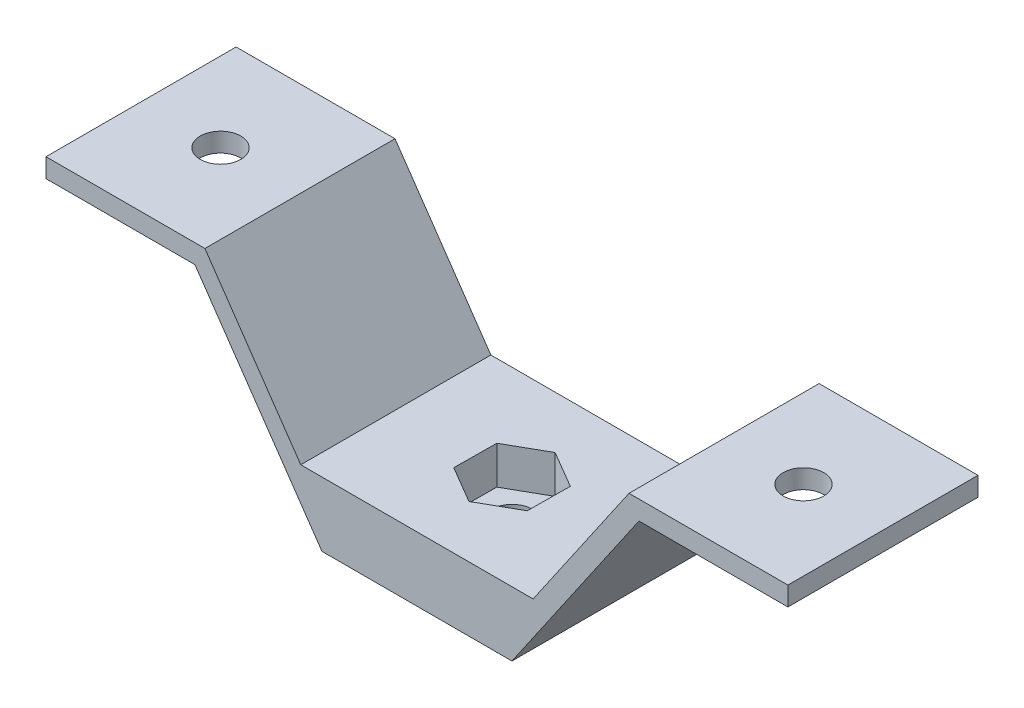
ISO-10303-21;
HEADER;
FILE_DESCRIPTION(('STEP AP214'),'2;1');
FILE_NAME('part.step','',(''),(''),'','','');
FILE_SCHEMA(('AUTOMOTIVE_DESIGN { 1 0 10303 214 1 1 1 1 }'));
ENDSEC;
DATA;
#1=APPLICATION_CONTEXT('core data for automotive mechanical design processes');
#2=APPLICATION_PROTOCOL_DEFINITION('international standard','automotive_design',2000,#1);
#3=PRODUCT_CONTEXT('',#1,'mechanical');
#4=PRODUCT('Part','Part','',(#3));
#5=PRODUCT_RELATED_PRODUCT_CATEGORY('part','',(#4));
#6=PRODUCT_DEFINITION_FORMATION('','',#4);
#7=PRODUCT_DEFINITION_CONTEXT('part definition',#1,'design');
#8=PRODUCT_DEFINITION('design','',#6,#7);
#9=PRODUCT_DEFINITION_SHAPE('','',#8);
#10=(LENGTH_UNIT() NAMED_UNIT(*) SI_UNIT(.MILLI.,.METRE.));
#11=(NAMED_UNIT(*) PLANE_ANGLE_UNIT() SI_UNIT($,.RADIAN.));
#12=(NAMED_UNIT(*) SI_UNIT($,.STERADIAN.) SOLID_ANGLE_UNIT());
#13=UNCERTAINTY_MEASURE_WITH_UNIT(LENGTH_MEASURE(1.E-05),#10,'distance_accuracy_value','');
#14=(GEOMETRIC_REPRESENTATION_CONTEXT(3) GLOBAL_UNCERTAINTY_ASSIGNED_CONTEXT((#13)) GLOBAL_UNIT_ASSIGNED_CONTEXT((#10,
#11,#12)) REPRESENTATION_CONTEXT('',''));
#15=CARTESIAN_POINT('',(0.,0.,0.));
#16=DIRECTION('',(0.,0.,1.));
#17=DIRECTION('',(1.,0.,0.));
#18=AXIS2_PLACEMENT_3D('',#15,#16,#17);
#19=CARTESIAN_POINT('',(0.00612912349975958,-0.0010000000000062,-15.));
#20=DIRECTION('',(0.,1.,0.));
#21=DIRECTION('',(-1.,0.,0.));
#22=AXIS2_PLACEMENT_3D('',#19,#20,#21);
#23=CYLINDRICAL_SURFACE('',#22,3.2);
#24=CARTESIAN_POINT('',(0.00612912349975958,0.,-15.));
#25=DIRECTION('',(0.,-1.,0.));
#26=DIRECTION('',(1.,0.,0.));
#27=AXIS2_PLACEMENT_3D('',#24,#25,#26);
#28=CIRCLE('',#27,3.2);
#29=CARTESIAN_POINT('',(3.20612912349976,0.,-15.));
#30=VERTEX_POINT('',#29);
#31=EDGE_CURVE('E277',#30,#30,#28,.F.);
#32=ORIENTED_EDGE('',*,*,#31,.F.);
#33=EDGE_LOOP('',(#32));
#34=FACE_BOUND('',#33,.T.);
#35=CARTESIAN_POINT('',(0.00612912349975919,4.16,-15.));
#36=DIRECTION('',(0.,1.,0.));
#37=DIRECTION('',(0.,0.,1.));
#38=AXIS2_PLACEMENT_3D('',#35,#36,#37);
#39=CIRCLE('',#38,3.2);
#40=CARTESIAN_POINT('',(0.00612912349975919,4.16,-11.8));
#41=VERTEX_POINT('',#40);
#42=EDGE_CURVE('E40',#41,#41,#39,.F.);
#43=ORIENTED_EDGE('',*,*,#42,.F.);
#44=EDGE_LOOP('',(#43));
#45=FACE_BOUND('',#44,.T.);
#46=ADVANCED_FACE('F36',(#34,#45),#23,.F.);
#47=CARTESIAN_POINT('',(18.3350758324807,10.16,-30.));
#48=DIRECTION('',(0.,1.,0.));
#49=DIRECTION('',(-1.,0.,0.));
#50=AXIS2_PLACEMENT_3D('',#47,#48,#49);
#51=PLANE('',#50);
#52=DIRECTION('',(-0.869887826411869,0.,0.493249601581626));
#53=VECTOR('',#52,1.);
#54=CARTESIAN_POINT('',(0.0585924401444242,10.16,-21.7455565325435));
#55=LINE('',#54,#53);
#56=CARTESIAN_POINT('',(0.0585924401444242,10.16,-21.7455565325435));
#57=VERTEX_POINT('',#56);
#58=CARTESIAN_POINT('',(-5.80946253802463,10.16,-18.4182128312528));
#59=VERTEX_POINT('',#58);
#60=EDGE_CURVE('E53',#57,#59,#55,.T.);
#61=ORIENTED_EDGE('',*,*,#60,.F.);
#62=DIRECTION('',(-0.862110598582177,0.,-0.506720155324693));
#63=VECTOR('',#62,1.);
#64=CARTESIAN_POINT('',(5.87418410166882,10.16,-18.3273437012907));
#65=LINE('',#64,#63);
#66=CARTESIAN_POINT('',(5.87418410166882,10.16,-18.3273437012907));
#67=VERTEX_POINT('',#66);
#68=EDGE_CURVE('E297',#67,#57,#65,.T.);
#69=ORIENTED_EDGE('',*,*,#68,.F.);
#70=DIRECTION('',(0.00777722782969246,0.,-0.99996975690632));
#71=VECTOR('',#70,1.);
#72=CARTESIAN_POINT('',(5.82172078502416,10.16,-11.5817871687472));
#73=LINE('',#72,#71);
#74=CARTESIAN_POINT('',(5.82172078502416,10.16,-11.5817871687472));
#75=VERTEX_POINT('',#74);
#76=EDGE_CURVE('E301',#75,#67,#73,.T.);
#77=ORIENTED_EDGE('',*,*,#76,.F.);
#78=DIRECTION('',(0.869887826411869,0.,-0.493249601581627));
#79=VECTOR('',#78,1.);
#80=CARTESIAN_POINT('',(-0.0463341931448956,10.16,-8.25444346745651));
#81=LINE('',#80,#79);
#82=CARTESIAN_POINT('',(-0.0463341931448956,10.16,-8.25444346745651));
#83=VERTEX_POINT('',#82);
#84=EDGE_CURVE('E304',#83,#75,#81,.T.);
#85=ORIENTED_EDGE('',*,*,#84,.F.);
#86=DIRECTION('',(0.862110598582177,0.,0.506720155324693));
#87=VECTOR('',#86,1.);
#88=CARTESIAN_POINT('',(-5.86192585466929,10.16,-11.6726562987093));
#89=LINE('',#88,#87);
#90=CARTESIAN_POINT('',(-5.86192585466929,10.16,-11.6726562987093));
#91=VERTEX_POINT('',#90);
#92=EDGE_CURVE('E307',#91,#83,#89,.T.);
#93=ORIENTED_EDGE('',*,*,#92,.F.);
#94=DIRECTION('',(-0.00777722782969272,0.,0.99996975690632));
#95=VECTOR('',#94,1.);
#96=CARTESIAN_POINT('',(-5.80946253802463,10.16,-18.4182128312528));
#97=LINE('',#96,#95);
#98=EDGE_CURVE('E310',#59,#91,#97,.T.);
#99=ORIENTED_EDGE('',*,*,#98,.F.);
#100=EDGE_LOOP('',(#61,#69,#77,#85,#93,#99));
#101=FACE_BOUND('',#100,.T.);
#102=DIRECTION('',(-1.,0.,0.));
#103=VECTOR('',#102,1.);
#104=CARTESIAN_POINT('',(18.3350758324807,10.16,0.));
#105=LINE('',#104,#103);
#106=CARTESIAN_POINT('',(18.3350758324807,10.16,0.));
#107=VERTEX_POINT('',#106);
#108=CARTESIAN_POINT('',(-18.3350758324807,10.16,0.));
#109=VERTEX_POINT('',#108);
#110=EDGE_CURVE('E155',#107,#109,#105,.T.);
#111=ORIENTED_EDGE('',*,*,#110,.F.);
#112=DIRECTION('',(0.,0.,1.));
#113=VECTOR('',#112,1.);
#114=CARTESIAN_POINT('',(18.3350758324807,10.16,-30.));
#115=LINE('',#114,#113);
#116=CARTESIAN_POINT('',(18.3350758324807,10.16,-30.));
#117=VERTEX_POINT('',#116);
#118=EDGE_CURVE('E11',#117,#107,#115,.T.);
#119=ORIENTED_EDGE('',*,*,#118,.F.);
#120=DIRECTION('',(-1.,0.,0.));
#121=VECTOR('',#120,1.);
#122=CARTESIAN_POINT('',(18.3350758324807,10.16,-30.));
#123=LINE('',#122,#121);
#124=CARTESIAN_POINT('',(-18.3350758324807,10.16,-30.));
#125=VERTEX_POINT('',#124);
#126=EDGE_CURVE('E138',#117,#125,#123,.T.);
#127=ORIENTED_EDGE('',*,*,#126,.T.);
#128=DIRECTION('',(0.,0.,1.));
#129=VECTOR('',#128,1.);
#130=CARTESIAN_POINT('',(-18.3350758324807,10.16,-30.));
#131=LINE('',#130,#129);
#132=EDGE_CURVE('E204',#125,#109,#131,.T.);
#133=ORIENTED_EDGE('',*,*,#132,.T.);
#134=EDGE_LOOP('',(#111,#119,#127,#133));
#135=FACE_BOUND('',#134,.T.);
#136=ADVANCED_FACE('F214',(#101,#135),#51,.T.);
#137=CARTESIAN_POINT('',(33.460443859835,32.16,-30.));
#138=DIRECTION('',(-0.824035488759448,0.566538183413066,0.));
#139=DIRECTION('',(-0.566538183413066,-0.824035488759448,0.));
#140=AXIS2_PLACEMENT_3D('',#137,#138,#139);
#141=PLANE('',#140);
#142=DIRECTION('',(-0.566538183413066,-0.824035488759448,0.));
#143=VECTOR('',#142,1.);
#144=CARTESIAN_POINT('',(33.460443859835,32.16,0.));
#145=LINE('',#144,#143);
#146=CARTESIAN_POINT('',(33.460443859835,32.16,0.));
#147=VERTEX_POINT('',#146);
#148=EDGE_CURVE('E153',#147,#107,#145,.T.);
#149=ORIENTED_EDGE('',*,*,#148,.F.);
#150=DIRECTION('',(0.,0.,1.));
#151=VECTOR('',#150,1.);
#152=CARTESIAN_POINT('',(33.460443859835,32.16,-30.));
#153=LINE('',#152,#151);
#154=CARTESIAN_POINT('',(33.460443859835,32.16,-30.));
#155=VERTEX_POINT('',#154);
#156=EDGE_CURVE('E45',#155,#147,#153,.T.);
#157=ORIENTED_EDGE('',*,*,#156,.F.);
#158=DIRECTION('',(-0.566538183413066,-0.824035488759448,0.));
#159=VECTOR('',#158,1.);
#160=CARTESIAN_POINT('',(33.460443859835,32.16,-30.));
#161=LINE('',#160,#159);
#162=EDGE_CURVE('E128',#155,#117,#161,.T.);
#163=ORIENTED_EDGE('',*,*,#162,.T.);
#164=ORIENTED_EDGE('',*,*,#118,.T.);
#165=EDGE_LOOP('',(#149,#157,#163,#164));
#166=FACE_BOUND('',#165,.T.);
#167=ADVANCED_FACE('F392',(#166),#141,.T.);
#168=CARTESIAN_POINT('',(58.539556140165,32.16,-30.));
#169=DIRECTION('',(0.,1.,0.));
#170=DIRECTION('',(0.,0.,1.));
#171=AXIS2_PLACEMENT_3D('',#168,#169,#170);
#172=PLANE('',#171);
#173=CARTESIAN_POINT('',(46.,32.16,-15.));
#174=DIRECTION('',(0.,-1.,0.));
#175=DIRECTION('',(1.,0.,0.));
#176=AXIS2_PLACEMENT_3D('',#173,#174,#175);
#177=CIRCLE('',#176,3.2);
#178=CARTESIAN_POINT('',(49.2,32.16,-15.));
#179=VERTEX_POINT('',#178);
#180=EDGE_CURVE('E274',#179,#179,#177,.T.);
#181=ORIENTED_EDGE('',*,*,#180,.T.);
#182=EDGE_LOOP('',(#181));
#183=FACE_BOUND('',#182,.T.);
#184=DIRECTION('',(-1.,0.,0.));
#185=VECTOR('',#184,1.);
#186=CARTESIAN_POINT('',(58.539556140165,32.16,0.));
#187=LINE('',#186,#185);
#188=CARTESIAN_POINT('',(58.539556140165,32.16,0.));
#189=VERTEX_POINT('',#188);
#190=EDGE_CURVE('E112',#189,#147,#187,.T.);
#191=ORIENTED_EDGE('',*,*,#190,.F.);
#192=DIRECTION('',(0.,0.,1.));
#193=VECTOR('',#192,1.);
#194=CARTESIAN_POINT('',(58.539556140165,32.16,-30.));
#195=LINE('',#194,#193);
#196=CARTESIAN_POINT('',(58.539556140165,32.16,-30.));
#197=VERTEX_POINT('',#196);
#198=EDGE_CURVE('E107',#197,#189,#195,.T.);
#199=ORIENTED_EDGE('',*,*,#198,.F.);
#200=DIRECTION('',(-1.,0.,0.));
#201=VECTOR('',#200,1.);
#202=CARTESIAN_POINT('',(58.539556140165,32.16,-30.));
#203=LINE('',#202,#201);
#204=EDGE_CURVE('E110',#197,#155,#203,.T.);
#205=ORIENTED_EDGE('',*,*,#204,.T.);
#206=ORIENTED_EDGE('',*,*,#156,.T.);
#207=EDGE_LOOP('',(#191,#199,#205,#206));
#208=FACE_BOUND('',#207,.T.);
#209=ADVANCED_FACE('F109',(#183,#208),#172,.T.);
#210=CARTESIAN_POINT('',(58.539556140165,29.16,-30.));
#211=DIRECTION('',(1.,0.,0.));
#212=DIRECTION('',(0.,0.,-1.));
#213=AXIS2_PLACEMENT_3D('',#210,#211,#212);
#214=PLANE('',#213);
#215=DIRECTION('',(0.,1.,0.));
#216=VECTOR('',#215,1.);
#217=CARTESIAN_POINT('',(58.539556140165,29.16,0.));
#218=LINE('',#217,#216);
#219=CARTESIAN_POINT('',(58.539556140165,29.16,0.));
#220=VERTEX_POINT('',#219);
#221=EDGE_CURVE('E150',#220,#189,#218,.T.);
#222=ORIENTED_EDGE('',*,*,#221,.F.);
#223=DIRECTION('',(0.,0.,1.));
#224=VECTOR('',#223,1.);
#225=CARTESIAN_POINT('',(58.539556140165,29.16,-30.));
#226=LINE('',#225,#224);
#227=CARTESIAN_POINT('',(58.539556140165,29.16,-30.));
#228=VERTEX_POINT('',#227);
#229=EDGE_CURVE('E117',#228,#220,#226,.T.);
#230=ORIENTED_EDGE('',*,*,#229,.F.);
#231=DIRECTION('',(0.,1.,0.));
#232=VECTOR('',#231,1.);
#233=CARTESIAN_POINT('',(58.539556140165,29.16,-30.));
#234=LINE('',#233,#232);
#235=EDGE_CURVE('E125',#228,#197,#234,.T.);
#236=ORIENTED_EDGE('',*,*,#235,.T.);
#237=ORIENTED_EDGE('',*,*,#198,.T.);
#238=EDGE_LOOP('',(#222,#230,#236,#237));
#239=FACE_BOUND('',#238,.T.);
#240=ADVANCED_FACE('F130',(#239),#214,.T.);
#241=CARTESIAN_POINT('',(35.0385135758839,29.16,-30.));
#242=DIRECTION('',(0.,-1.,0.));
#243=DIRECTION('',(0.,0.,-1.));
#244=AXIS2_PLACEMENT_3D('',#241,#242,#243);
#245=PLANE('',#244);
#246=CARTESIAN_POINT('',(46.,29.16,-15.));
#247=DIRECTION('',(0.,-1.,0.));
#248=DIRECTION('',(0.,0.,-1.));
#249=AXIS2_PLACEMENT_3D('',#246,#247,#248);
#250=CIRCLE('',#249,3.2);
#251=CARTESIAN_POINT('',(46.,29.16,-18.2));
#252=VERTEX_POINT('',#251);
#253=EDGE_CURVE('E271',#252,#252,#250,.T.);
#254=ORIENTED_EDGE('',*,*,#253,.F.);
#255=EDGE_LOOP('',(#254));
#256=FACE_BOUND('',#255,.T.);
#257=DIRECTION('',(1.,0.,0.));
#258=VECTOR('',#257,1.);
#259=CARTESIAN_POINT('',(35.0385135758839,29.16,0.));
#260=LINE('',#259,#258);
#261=CARTESIAN_POINT('',(35.0385135758839,29.16,0.));
#262=VERTEX_POINT('',#261);
#263=EDGE_CURVE('E147',#262,#220,#260,.T.);
#264=ORIENTED_EDGE('',*,*,#263,.F.);
#265=DIRECTION('',(0.,0.,1.));
#266=VECTOR('',#265,1.);
#267=CARTESIAN_POINT('',(35.0385135758839,29.16,-30.));
#268=LINE('',#267,#266);
#269=CARTESIAN_POINT('',(35.0385135758839,29.16,-30.));
#270=VERTEX_POINT('',#269);
#271=EDGE_CURVE('E161',#270,#262,#268,.T.);
#272=ORIENTED_EDGE('',*,*,#271,.F.);
#273=DIRECTION('',(1.,0.,0.));
#274=VECTOR('',#273,1.);
#275=CARTESIAN_POINT('',(35.0385135758839,29.16,-30.));
#276=LINE('',#275,#274);
#277=EDGE_CURVE('E131',#270,#228,#276,.T.);
#278=ORIENTED_EDGE('',*,*,#277,.T.);
#279=ORIENTED_EDGE('',*,*,#229,.T.);
#280=EDGE_LOOP('',(#264,#272,#278,#279));
#281=FACE_BOUND('',#280,.T.);
#282=ADVANCED_FACE('F210',(#256,#281),#245,.T.);
#283=CARTESIAN_POINT('',(14.9905257723542,0.,-30.));
#284=DIRECTION('',(0.824035488759448,-0.566538183413066,0.));
#285=DIRECTION('',(0.566538183413066,0.824035488759448,0.));
#286=AXIS2_PLACEMENT_3D('',#283,#284,#285);
#287=PLANE('',#286);
#288=DIRECTION('',(0.566538183413066,0.824035488759448,0.));
#289=VECTOR('',#288,1.);
#290=CARTESIAN_POINT('',(14.9905257723542,0.,0.));
#291=LINE('',#290,#289);
#292=CARTESIAN_POINT('',(14.9905257723542,0.,0.));
#293=VERTEX_POINT('',#292);
#294=EDGE_CURVE('E143',#293,#262,#291,.T.);
#295=ORIENTED_EDGE('',*,*,#294,.F.);
#296=DIRECTION('',(0.,0.,1.));
#297=VECTOR('',#296,1.);
#298=CARTESIAN_POINT('',(14.9905257723542,0.,-30.));
#299=LINE('',#298,#297);
#300=CARTESIAN_POINT('',(14.9905257723542,0.,-30.));
#301=VERTEX_POINT('',#300);
#302=EDGE_CURVE('E93',#301,#293,#299,.T.);
#303=ORIENTED_EDGE('',*,*,#302,.F.);
#304=DIRECTION('',(0.566538183413066,0.824035488759448,0.));
#305=VECTOR('',#304,1.);
#306=CARTESIAN_POINT('',(14.9905257723542,0.,-30.));
#307=LINE('',#306,#305);
#308=EDGE_CURVE('E133',#301,#270,#307,.T.);
#309=ORIENTED_EDGE('',*,*,#308,.T.);
#310=ORIENTED_EDGE('',*,*,#271,.T.);
#311=EDGE_LOOP('',(#295,#303,#309,#310));
#312=FACE_BOUND('',#311,.T.);
#313=ADVANCED_FACE('F167',(#312),#287,.T.);
#314=CARTESIAN_POINT('',(0.,0.,-30.));
#315=DIRECTION('',(0.,-1.,0.));
#316=DIRECTION('',(1.,0.,0.));
#317=AXIS2_PLACEMENT_3D('',#314,#315,#316);
#318=PLANE('',#317);
#319=ORIENTED_EDGE('',*,*,#31,.T.);
#320=EDGE_LOOP('',(#319));
#321=FACE_BOUND('',#320,.T.);
#322=DIRECTION('',(1.,0.,0.));
#323=VECTOR('',#322,1.);
#324=CARTESIAN_POINT('',(0.,0.,0.));
#325=LINE('',#324,#323);
#326=CARTESIAN_POINT('',(-14.9905257723542,0.,0.));
#327=VERTEX_POINT('',#326);
#328=EDGE_CURVE('E140',#327,#293,#325,.T.);
#329=ORIENTED_EDGE('',*,*,#328,.F.);
#330=DIRECTION('',(0.,0.,1.));
#331=VECTOR('',#330,1.);
#332=CARTESIAN_POINT('',(-14.9905257723542,0.,-30.));
#333=LINE('',#332,#331);
#334=CARTESIAN_POINT('',(-14.9905257723542,0.,-30.));
#335=VERTEX_POINT('',#334);
#336=EDGE_CURVE('E144',#335,#327,#333,.T.);
#337=ORIENTED_EDGE('',*,*,#336,.F.);
#338=DIRECTION('',(1.,0.,0.));
#339=VECTOR('',#338,1.);
#340=CARTESIAN_POINT('',(0.,0.,-30.));
#341=LINE('',#340,#339);
#342=EDGE_CURVE('E157',#335,#301,#341,.T.);
#343=ORIENTED_EDGE('',*,*,#342,.T.);
#344=ORIENTED_EDGE('',*,*,#302,.T.);
#345=EDGE_LOOP('',(#329,#337,#343,#344));
#346=FACE_BOUND('',#345,.T.);
#347=ADVANCED_FACE('F38',(#321,#346),#318,.T.);
#348=CARTESIAN_POINT('',(0.,0.,-30.));
#349=DIRECTION('',(0.,0.,1.));
#350=DIRECTION('',(1.,0.,0.));
#351=AXIS2_PLACEMENT_3D('',#348,#349,#350);
#352=PLANE('',#351);
#353=ORIENTED_EDGE('',*,*,#342,.F.);
#354=DIRECTION('',(-0.566538183413066,0.824035488759448,0.));
#355=VECTOR('',#354,1.);
#356=CARTESIAN_POINT('',(-14.9905257723542,0.,-30.));
#357=LINE('',#356,#355);
#358=CARTESIAN_POINT('',(-35.0385135758839,29.16,-30.));
#359=VERTEX_POINT('',#358);
#360=EDGE_CURVE('E207',#335,#359,#357,.T.);
#361=ORIENTED_EDGE('',*,*,#360,.T.);
#362=DIRECTION('',(-1.,0.,0.));
#363=VECTOR('',#362,1.);
#364=CARTESIAN_POINT('',(-35.0385135758839,29.16,-30.));
#365=LINE('',#364,#363);
#366=CARTESIAN_POINT('',(-58.539556140165,29.16,-30.));
#367=VERTEX_POINT('',#366);
#368=EDGE_CURVE('E262',#359,#367,#365,.T.);
#369=ORIENTED_EDGE('',*,*,#368,.T.);
#370=DIRECTION('',(0.,1.,0.));
#371=VECTOR('',#370,1.);
#372=CARTESIAN_POINT('',(-58.539556140165,29.16,-30.));
#373=LINE('',#372,#371);
#374=CARTESIAN_POINT('',(-58.539556140165,32.16,-30.));
#375=VERTEX_POINT('',#374);
#376=EDGE_CURVE('E254',#367,#375,#373,.T.);
#377=ORIENTED_EDGE('',*,*,#376,.T.);
#378=DIRECTION('',(1.,0.,0.));
#379=VECTOR('',#378,1.);
#380=CARTESIAN_POINT('',(-58.539556140165,32.16,-30.));
#381=LINE('',#380,#379);
#382=CARTESIAN_POINT('',(-33.460443859835,32.16,-30.));
#383=VERTEX_POINT('',#382);
#384=EDGE_CURVE('E186',#375,#383,#381,.T.);
#385=ORIENTED_EDGE('',*,*,#384,.T.);
#386=DIRECTION('',(0.566538183413066,-0.824035488759448,0.));
#387=VECTOR('',#386,1.);
#388=CARTESIAN_POINT('',(-33.460443859835,32.16,-30.));
#389=LINE('',#388,#387);
#390=EDGE_CURVE('E183',#383,#125,#389,.T.);
#391=ORIENTED_EDGE('',*,*,#390,.T.);
#392=ORIENTED_EDGE('',*,*,#126,.F.);
#393=ORIENTED_EDGE('',*,*,#162,.F.);
#394=ORIENTED_EDGE('',*,*,#204,.F.);
#395=ORIENTED_EDGE('',*,*,#235,.F.);
#396=ORIENTED_EDGE('',*,*,#277,.F.);
#397=ORIENTED_EDGE('',*,*,#308,.F.);
#398=EDGE_LOOP('',(#353,#361,#369,#377,#385,#391,#392,#393,#394,#395,#396,#397));
#399=FACE_BOUND('',#398,.T.);
#400=ADVANCED_FACE('F123',(#399),#352,.F.);
#401=CARTESIAN_POINT('',(0.,0.,0.));
#402=DIRECTION('',(0.,0.,1.));
#403=DIRECTION('',(1.,0.,0.));
#404=AXIS2_PLACEMENT_3D('',#401,#402,#403);
#405=PLANE('',#404);
#406=ORIENTED_EDGE('',*,*,#110,.T.);
#407=DIRECTION('',(0.566538183413066,-0.824035488759448,0.));
#408=VECTOR('',#407,1.);
#409=CARTESIAN_POINT('',(-33.460443859835,32.16,0.));
#410=LINE('',#409,#408);
#411=CARTESIAN_POINT('',(-33.460443859835,32.16,0.));
#412=VERTEX_POINT('',#411);
#413=EDGE_CURVE('E223',#412,#109,#410,.T.);
#414=ORIENTED_EDGE('',*,*,#413,.F.);
#415=DIRECTION('',(1.,0.,0.));
#416=VECTOR('',#415,1.);
#417=CARTESIAN_POINT('',(-58.539556140165,32.16,0.));
#418=LINE('',#417,#416);
#419=CARTESIAN_POINT('',(-58.539556140165,32.16,0.));
#420=VERTEX_POINT('',#419);
#421=EDGE_CURVE('E256',#420,#412,#418,.T.);
#422=ORIENTED_EDGE('',*,*,#421,.F.);
#423=DIRECTION('',(0.,1.,0.));
#424=VECTOR('',#423,1.);
#425=CARTESIAN_POINT('',(-58.539556140165,29.16,0.));
#426=LINE('',#425,#424);
#427=CARTESIAN_POINT('',(-58.539556140165,29.16,0.));
#428=VERTEX_POINT('',#427);
#429=EDGE_CURVE('E188',#428,#420,#426,.T.);
#430=ORIENTED_EDGE('',*,*,#429,.F.);
#431=DIRECTION('',(-1.,0.,0.));
#432=VECTOR('',#431,1.);
#433=CARTESIAN_POINT('',(-35.0385135758839,29.16,0.));
#434=LINE('',#433,#432);
#435=CARTESIAN_POINT('',(-35.0385135758839,29.16,0.));
#436=VERTEX_POINT('',#435);
#437=EDGE_CURVE('E178',#436,#428,#434,.T.);
#438=ORIENTED_EDGE('',*,*,#437,.F.);
#439=DIRECTION('',(-0.566538183413066,0.824035488759448,0.));
#440=VECTOR('',#439,1.);
#441=CARTESIAN_POINT('',(-14.9905257723542,0.,0.));
#442=LINE('',#441,#440);
#443=EDGE_CURVE('E174',#327,#436,#442,.T.);
#444=ORIENTED_EDGE('',*,*,#443,.F.);
#445=ORIENTED_EDGE('',*,*,#328,.T.);
#446=ORIENTED_EDGE('',*,*,#294,.T.);
#447=ORIENTED_EDGE('',*,*,#263,.T.);
#448=ORIENTED_EDGE('',*,*,#221,.T.);
#449=ORIENTED_EDGE('',*,*,#190,.T.);
#450=ORIENTED_EDGE('',*,*,#148,.T.);
#451=EDGE_LOOP('',(#406,#414,#422,#430,#438,#444,#445,#446,#447,#448,#449,#450));
#452=FACE_BOUND('',#451,.T.);
#453=ADVANCED_FACE('F171',(#452),#405,.T.);
#454=CARTESIAN_POINT('',(-14.9905257723542,0.,-30.));
#455=DIRECTION('',(0.824035488759448,0.566538183413066,0.));
#456=DIRECTION('',(-0.566538183413066,0.824035488759448,0.));
#457=AXIS2_PLACEMENT_3D('',#454,#455,#456);
#458=PLANE('',#457);
#459=ORIENTED_EDGE('',*,*,#443,.T.);
#460=DIRECTION('',(0.,0.,1.));
#461=VECTOR('',#460,1.);
#462=CARTESIAN_POINT('',(-35.0385135758839,29.16,-30.));
#463=LINE('',#462,#461);
#464=EDGE_CURVE('E193',#359,#436,#463,.T.);
#465=ORIENTED_EDGE('',*,*,#464,.F.);
#466=ORIENTED_EDGE('',*,*,#360,.F.);
#467=ORIENTED_EDGE('',*,*,#336,.T.);
#468=EDGE_LOOP('',(#459,#465,#466,#467));
#469=FACE_BOUND('',#468,.T.);
#470=ADVANCED_FACE('F407',(#469),#458,.F.);
#471=CARTESIAN_POINT('',(-35.0385135758839,29.16,-30.));
#472=DIRECTION('',(0.,1.,0.));
#473=DIRECTION('',(-1.,0.,0.));
#474=AXIS2_PLACEMENT_3D('',#471,#472,#473);
#475=PLANE('',#474);
#476=CARTESIAN_POINT('',(-46.,29.16,-15.));
#477=DIRECTION('',(0.,1.,0.));
#478=DIRECTION('',(-1.,0.,0.));
#479=AXIS2_PLACEMENT_3D('',#476,#477,#478);
#480=CIRCLE('',#479,3.2);
#481=CARTESIAN_POINT('',(-49.2,29.16,-15.));
#482=VERTEX_POINT('',#481);
#483=EDGE_CURVE('E260',#482,#482,#480,.F.);
#484=ORIENTED_EDGE('',*,*,#483,.F.);
#485=EDGE_LOOP('',(#484));
#486=FACE_BOUND('',#485,.T.);
#487=ORIENTED_EDGE('',*,*,#437,.T.);
#488=DIRECTION('',(0.,0.,1.));
#489=VECTOR('',#488,1.);
#490=CARTESIAN_POINT('',(-58.539556140165,29.16,-30.));
#491=LINE('',#490,#489);
#492=EDGE_CURVE('E195',#367,#428,#491,.T.);
#493=ORIENTED_EDGE('',*,*,#492,.F.);
#494=ORIENTED_EDGE('',*,*,#368,.F.);
#495=ORIENTED_EDGE('',*,*,#464,.T.);
#496=EDGE_LOOP('',(#487,#493,#494,#495));
#497=FACE_BOUND('',#496,.T.);
#498=ADVANCED_FACE('F248',(#486,#497),#475,.F.);
#499=CARTESIAN_POINT('',(-58.539556140165,29.16,-30.));
#500=DIRECTION('',(1.,0.,0.));
#501=DIRECTION('',(0.,1.,0.));
#502=AXIS2_PLACEMENT_3D('',#499,#500,#501);
#503=PLANE('',#502);
#504=ORIENTED_EDGE('',*,*,#429,.T.);
#505=DIRECTION('',(0.,0.,1.));
#506=VECTOR('',#505,1.);
#507=CARTESIAN_POINT('',(-58.539556140165,32.16,-30.));
#508=LINE('',#507,#506);
#509=EDGE_CURVE('E198',#375,#420,#508,.T.);
#510=ORIENTED_EDGE('',*,*,#509,.F.);
#511=ORIENTED_EDGE('',*,*,#376,.F.);
#512=ORIENTED_EDGE('',*,*,#492,.T.);
#513=EDGE_LOOP('',(#504,#510,#511,#512));
#514=FACE_BOUND('',#513,.T.);
#515=ADVANCED_FACE('F252',(#514),#503,.F.);
#516=CARTESIAN_POINT('',(-58.539556140165,32.16,-30.));
#517=DIRECTION('',(0.,-1.,0.));
#518=DIRECTION('',(1.,0.,0.));
#519=AXIS2_PLACEMENT_3D('',#516,#517,#518);
#520=PLANE('',#519);
#521=CARTESIAN_POINT('',(-46.,32.16,-15.));
#522=DIRECTION('',(0.,1.,0.));
#523=DIRECTION('',(-1.,0.,0.));
#524=AXIS2_PLACEMENT_3D('',#521,#522,#523);
#525=CIRCLE('',#524,3.2);
#526=CARTESIAN_POINT('',(-49.2,32.16,-15.));
#527=VERTEX_POINT('',#526);
#528=EDGE_CURVE('E268',#527,#527,#525,.T.);
#529=ORIENTED_EDGE('',*,*,#528,.F.);
#530=EDGE_LOOP('',(#529));
#531=FACE_BOUND('',#530,.T.);
#532=ORIENTED_EDGE('',*,*,#421,.T.);
#533=DIRECTION('',(0.,0.,1.));
#534=VECTOR('',#533,1.);
#535=CARTESIAN_POINT('',(-33.460443859835,32.16,-30.));
#536=LINE('',#535,#534);
#537=EDGE_CURVE('E201',#383,#412,#536,.T.);
#538=ORIENTED_EDGE('',*,*,#537,.F.);
#539=ORIENTED_EDGE('',*,*,#384,.F.);
#540=ORIENTED_EDGE('',*,*,#509,.T.);
#541=EDGE_LOOP('',(#532,#538,#539,#540));
#542=FACE_BOUND('',#541,.T.);
#543=ADVANCED_FACE('F415',(#531,#542),#520,.F.);
#544=CARTESIAN_POINT('',(-33.460443859835,32.16,-30.));
#545=DIRECTION('',(-0.824035488759448,-0.566538183413066,0.));
#546=DIRECTION('',(0.566538183413066,-0.824035488759448,0.));
#547=AXIS2_PLACEMENT_3D('',#544,#545,#546);
#548=PLANE('',#547);
#549=ORIENTED_EDGE('',*,*,#413,.T.);
#550=ORIENTED_EDGE('',*,*,#132,.F.);
#551=ORIENTED_EDGE('',*,*,#390,.F.);
#552=ORIENTED_EDGE('',*,*,#537,.T.);
#553=EDGE_LOOP('',(#549,#550,#551,#552));
#554=FACE_BOUND('',#553,.T.);
#555=ADVANCED_FACE('F221',(#554),#548,.F.);
#556=CARTESIAN_POINT('',(-46.,-0.001000000000001,-15.));
#557=DIRECTION('',(0.,1.,0.));
#558=DIRECTION('',(-1.,0.,0.));
#559=AXIS2_PLACEMENT_3D('',#556,#557,#558);
#560=CYLINDRICAL_SURFACE('',#559,3.2);
#561=ORIENTED_EDGE('',*,*,#528,.T.);
#562=EDGE_LOOP('',(#561));
#563=FACE_BOUND('',#562,.T.);
#564=ORIENTED_EDGE('',*,*,#483,.T.);
#565=EDGE_LOOP('',(#564));
#566=FACE_BOUND('',#565,.T.);
#567=ADVANCED_FACE('F402',(#563,#566),#560,.F.);
#568=CARTESIAN_POINT('',(46.,-0.001000000000001,-15.));
#569=DIRECTION('',(0.,1.,0.));
#570=DIRECTION('',(-1.,0.,0.));
#571=AXIS2_PLACEMENT_3D('',#568,#569,#570);
#572=CYLINDRICAL_SURFACE('',#571,3.2);
#573=ORIENTED_EDGE('',*,*,#253,.T.);
#574=EDGE_LOOP('',(#573));
#575=FACE_BOUND('',#574,.T.);
#576=ORIENTED_EDGE('',*,*,#180,.F.);
#577=EDGE_LOOP('',(#576));
#578=FACE_BOUND('',#577,.T.);
#579=ADVANCED_FACE('F399',(#575,#578),#572,.F.);
#580=CARTESIAN_POINT('',(0.,4.16,0.));
#581=DIRECTION('',(0.,1.,0.));
#582=DIRECTION('',(0.,0.,1.));
#583=AXIS2_PLACEMENT_3D('',#580,#581,#582);
#584=PLANE('',#583);
#585=DIRECTION('',(-0.869887826411869,0.,0.493249601581626));
#586=VECTOR('',#585,1.);
#587=CARTESIAN_POINT('',(0.0585924401444248,4.16,-21.7455565325435));
#588=LINE('',#587,#586);
#589=CARTESIAN_POINT('',(0.0585924401444248,4.16,-21.7455565325435));
#590=VERTEX_POINT('',#589);
#591=CARTESIAN_POINT('',(-5.80946253802463,4.16,-18.4182128312528));
#592=VERTEX_POINT('',#591);
#593=EDGE_CURVE('E300',#590,#592,#588,.T.);
#594=ORIENTED_EDGE('',*,*,#593,.T.);
#595=DIRECTION('',(-0.00777722782969272,0.,0.99996975690632));
#596=VECTOR('',#595,1.);
#597=CARTESIAN_POINT('',(-5.80946253802463,4.16,-18.4182128312528));
#598=LINE('',#597,#596);
#599=CARTESIAN_POINT('',(-5.86192585466929,4.16,-11.6726562987093));
#600=VERTEX_POINT('',#599);
#601=EDGE_CURVE('E325',#592,#600,#598,.T.);
#602=ORIENTED_EDGE('',*,*,#601,.T.);
#603=DIRECTION('',(0.862110598582177,0.,0.506720155324693));
#604=VECTOR('',#603,1.);
#605=CARTESIAN_POINT('',(-5.86192585466929,4.16,-11.6726562987093));
#606=LINE('',#605,#604);
#607=CARTESIAN_POINT('',(-0.046334193144895,4.16,-8.25444346745651));
#608=VERTEX_POINT('',#607);
#609=EDGE_CURVE('E322',#600,#608,#606,.T.);
#610=ORIENTED_EDGE('',*,*,#609,.T.);
#611=DIRECTION('',(0.869887826411869,0.,-0.493249601581627));
#612=VECTOR('',#611,1.);
#613=CARTESIAN_POINT('',(-0.046334193144895,4.16,-8.25444346745651));
#614=LINE('',#613,#612);
#615=CARTESIAN_POINT('',(5.82172078502416,4.16,-11.5817871687472));
#616=VERTEX_POINT('',#615);
#617=EDGE_CURVE('E319',#608,#616,#614,.T.);
#618=ORIENTED_EDGE('',*,*,#617,.T.);
#619=DIRECTION('',(0.00777722782969246,0.,-0.99996975690632));
#620=VECTOR('',#619,1.);
#621=CARTESIAN_POINT('',(5.82172078502416,4.16,-11.5817871687472));
#622=LINE('',#621,#620);
#623=CARTESIAN_POINT('',(5.87418410166882,4.16,-18.3273437012907));
#624=VERTEX_POINT('',#623);
#625=EDGE_CURVE('E316',#616,#624,#622,.T.);
#626=ORIENTED_EDGE('',*,*,#625,.T.);
#627=DIRECTION('',(-0.862110598582177,0.,-0.506720155324693));
#628=VECTOR('',#627,1.);
#629=CARTESIAN_POINT('',(5.87418410166882,4.16,-18.3273437012907));
#630=LINE('',#629,#628);
#631=EDGE_CURVE('E283',#624,#590,#630,.T.);
#632=ORIENTED_EDGE('',*,*,#631,.T.);
#633=EDGE_LOOP('',(#594,#602,#610,#618,#626,#632));
#634=FACE_BOUND('',#633,.T.);
#635=ORIENTED_EDGE('',*,*,#42,.T.);
#636=EDGE_LOOP('',(#635));
#637=FACE_BOUND('',#636,.T.);
#638=ADVANCED_FACE('F332',(#634,#637),#584,.T.);
#639=CARTESIAN_POINT('',(0.0585924401444248,4.16,-21.7455565325435));
#640=DIRECTION('',(-0.493249601581626,0.,-0.869887826411869));
#641=DIRECTION('',(-0.86988782641187,0.,0.493249601581626));
#642=AXIS2_PLACEMENT_3D('',#639,#640,#641);
#643=PLANE('',#642);
#644=ORIENTED_EDGE('',*,*,#60,.T.);
#645=DIRECTION('',(0.,1.,0.));
#646=VECTOR('',#645,1.);
#647=CARTESIAN_POINT('',(-5.80946253802463,4.16,-18.4182128312528));
#648=LINE('',#647,#646);
#649=EDGE_CURVE('E280',#592,#59,#648,.T.);
#650=ORIENTED_EDGE('',*,*,#649,.F.);
#651=ORIENTED_EDGE('',*,*,#593,.F.);
#652=DIRECTION('',(0.,1.,0.));
#653=VECTOR('',#652,1.);
#654=CARTESIAN_POINT('',(0.0585924401444248,4.16,-21.7455565325435));
#655=LINE('',#654,#653);
#656=EDGE_CURVE('E295',#590,#57,#655,.T.);
#657=ORIENTED_EDGE('',*,*,#656,.T.);
#658=EDGE_LOOP('',(#644,#650,#651,#657));
#659=FACE_BOUND('',#658,.T.);
#660=ADVANCED_FACE('F338',(#659),#643,.F.);
#661=CARTESIAN_POINT('',(5.87418410166882,4.16,-18.3273437012907));
#662=DIRECTION('',(0.506720155324693,0.,-0.862110598582177));
#663=DIRECTION('',(-0.862110598582177,0.,-0.506720155324693));
#664=AXIS2_PLACEMENT_3D('',#661,#662,#663);
#665=PLANE('',#664);
#666=ORIENTED_EDGE('',*,*,#68,.T.);
#667=ORIENTED_EDGE('',*,*,#656,.F.);
#668=ORIENTED_EDGE('',*,*,#631,.F.);
#669=DIRECTION('',(0.,1.,0.));
#670=VECTOR('',#669,1.);
#671=CARTESIAN_POINT('',(5.87418410166882,4.16,-18.3273437012907));
#672=LINE('',#671,#670);
#673=EDGE_CURVE('E292',#624,#67,#672,.T.);
#674=ORIENTED_EDGE('',*,*,#673,.T.);
#675=EDGE_LOOP('',(#666,#667,#668,#674));
#676=FACE_BOUND('',#675,.T.);
#677=ADVANCED_FACE('F354',(#676),#665,.F.);
#678=CARTESIAN_POINT('',(5.82172078502416,4.16,-11.5817871687472));
#679=DIRECTION('',(0.99996975690632,0.,0.00777722782969246));
#680=DIRECTION('',(0.00777722782969246,0.,-0.99996975690632));
#681=AXIS2_PLACEMENT_3D('',#678,#679,#680);
#682=PLANE('',#681);
#683=ORIENTED_EDGE('',*,*,#76,.T.);
#684=ORIENTED_EDGE('',*,*,#673,.F.);
#685=ORIENTED_EDGE('',*,*,#625,.F.);
#686=DIRECTION('',(0.,1.,0.));
#687=VECTOR('',#686,1.);
#688=CARTESIAN_POINT('',(5.82172078502416,4.16,-11.5817871687472));
#689=LINE('',#688,#687);
#690=EDGE_CURVE('E289',#616,#75,#689,.T.);
#691=ORIENTED_EDGE('',*,*,#690,.T.);
#692=EDGE_LOOP('',(#683,#684,#685,#691));
#693=FACE_BOUND('',#692,.T.);
#694=ADVANCED_FACE('F359',(#693),#682,.F.);
#695=CARTESIAN_POINT('',(-0.046334193144895,4.16,-8.25444346745651));
#696=DIRECTION('',(0.493249601581627,0.,0.869887826411869));
#697=DIRECTION('',(0.869887826411869,0.,-0.493249601581627));
#698=AXIS2_PLACEMENT_3D('',#695,#696,#697);
#699=PLANE('',#698);
#700=ORIENTED_EDGE('',*,*,#84,.T.);
#701=ORIENTED_EDGE('',*,*,#690,.F.);
#702=ORIENTED_EDGE('',*,*,#617,.F.);
#703=DIRECTION('',(0.,1.,0.));
#704=VECTOR('',#703,1.);
#705=CARTESIAN_POINT('',(-0.046334193144895,4.16,-8.25444346745651));
#706=LINE('',#705,#704);
#707=EDGE_CURVE('E286',#608,#83,#706,.T.);
#708=ORIENTED_EDGE('',*,*,#707,.T.);
#709=EDGE_LOOP('',(#700,#701,#702,#708));
#710=FACE_BOUND('',#709,.T.);
#711=ADVANCED_FACE('F377',(#710),#699,.F.);
#712=CARTESIAN_POINT('',(-5.86192585466929,4.16,-11.6726562987093));
#713=DIRECTION('',(-0.506720155324693,0.,0.862110598582177));
#714=DIRECTION('',(0.862110598582177,0.,0.506720155324693));
#715=AXIS2_PLACEMENT_3D('',#712,#713,#714);
#716=PLANE('',#715);
#717=ORIENTED_EDGE('',*,*,#92,.T.);
#718=ORIENTED_EDGE('',*,*,#707,.F.);
#719=ORIENTED_EDGE('',*,*,#609,.F.);
#720=DIRECTION('',(0.,1.,0.));
#721=VECTOR('',#720,1.);
#722=CARTESIAN_POINT('',(-5.86192585466929,4.16,-11.6726562987093));
#723=LINE('',#722,#721);
#724=EDGE_CURVE('E282',#600,#91,#723,.T.);
#725=ORIENTED_EDGE('',*,*,#724,.T.);
#726=EDGE_LOOP('',(#717,#718,#719,#725));
#727=FACE_BOUND('',#726,.T.);
#728=ADVANCED_FACE('F373',(#727),#716,.F.);
#729=CARTESIAN_POINT('',(-5.80946253802463,4.16,-18.4182128312528));
#730=DIRECTION('',(-0.99996975690632,0.,-0.00777722782969273));
#731=DIRECTION('',(-0.00777722782969273,0.,0.99996975690632));
#732=AXIS2_PLACEMENT_3D('',#729,#730,#731);
#733=PLANE('',#732);
#734=ORIENTED_EDGE('',*,*,#98,.T.);
#735=ORIENTED_EDGE('',*,*,#724,.F.);
#736=ORIENTED_EDGE('',*,*,#601,.F.);
#737=ORIENTED_EDGE('',*,*,#649,.T.);
#738=EDGE_LOOP('',(#734,#735,#736,#737));
#739=FACE_BOUND('',#738,.T.);
#740=ADVANCED_FACE('F367',(#739),#733,.F.);
#741=CLOSED_SHELL('',(#46,#136,#167,#209,#240,#282,#313,#347,#400,#453,#470,#498,#515,#543,#555,
#567,#579,#638,#660,#677,#694,#711,#728,#740));
#742=MANIFOLD_SOLID_BREP('B2',#741);
#743=ADVANCED_BREP_SHAPE_REPRESENTATION('',(#18,#742),#14);
#744=SHAPE_DEFINITION_REPRESENTATION(#9,#743);
ENDSEC;
END-ISO-10303-21;
